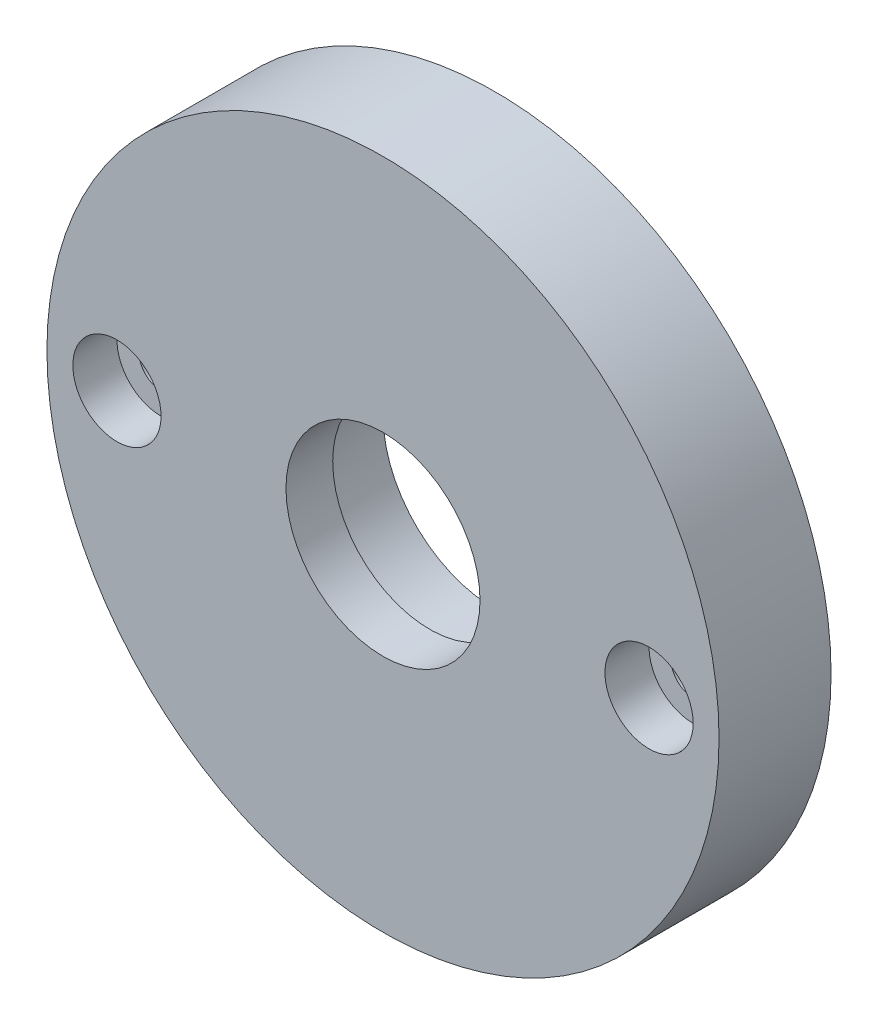
ISO-10303-21;
HEADER;
FILE_DESCRIPTION(('STEP AP214'),'2;1');
FILE_NAME('part.step','',(''),(''),'','','');
FILE_SCHEMA(('AUTOMOTIVE_DESIGN { 1 0 10303 214 1 1 1 1 }'));
ENDSEC;
DATA;
#1=APPLICATION_CONTEXT('core data for automotive mechanical design processes');
#2=APPLICATION_PROTOCOL_DEFINITION('international standard','automotive_design',2000,#1);
#3=PRODUCT_CONTEXT('',#1,'mechanical');
#4=PRODUCT('Part','Part','',(#3));
#5=PRODUCT_RELATED_PRODUCT_CATEGORY('part','',(#4));
#6=PRODUCT_DEFINITION_FORMATION('','',#4);
#7=PRODUCT_DEFINITION_CONTEXT('part definition',#1,'design');
#8=PRODUCT_DEFINITION('design','',#6,#7);
#9=PRODUCT_DEFINITION_SHAPE('','',#8);
#10=(LENGTH_UNIT() NAMED_UNIT(*) SI_UNIT(.MILLI.,.METRE.));
#11=(NAMED_UNIT(*) PLANE_ANGLE_UNIT() SI_UNIT($,.RADIAN.));
#12=(NAMED_UNIT(*) SI_UNIT($,.STERADIAN.) SOLID_ANGLE_UNIT());
#13=UNCERTAINTY_MEASURE_WITH_UNIT(LENGTH_MEASURE(1.E-05),#10,'distance_accuracy_value','');
#14=(GEOMETRIC_REPRESENTATION_CONTEXT(3) GLOBAL_UNCERTAINTY_ASSIGNED_CONTEXT((#13)) GLOBAL_UNIT_ASSIGNED_CONTEXT((#10,
#11,#12)) REPRESENTATION_CONTEXT('',''));
#15=CARTESIAN_POINT('',(0.,0.,0.));
#16=DIRECTION('',(0.,0.,1.));
#17=DIRECTION('',(1.,0.,0.));
#18=AXIS2_PLACEMENT_3D('',#15,#16,#17);
#19=CARTESIAN_POINT('',(-7.1502088960035,8.43588789117627,0.));
#20=DIRECTION('',(0.,0.,1.));
#21=DIRECTION('',(1.,0.,0.));
#22=AXIS2_PLACEMENT_3D('',#19,#20,#21);
#23=CYLINDRICAL_SURFACE('',#22,2.5);
#24=CARTESIAN_POINT('',(-7.1502088960035,8.43588789117627,0.));
#25=DIRECTION('',(0.,0.,1.));
#26=DIRECTION('',(1.,0.,0.));
#27=AXIS2_PLACEMENT_3D('',#24,#25,#26);
#28=CIRCLE('',#27,2.5);
#29=CARTESIAN_POINT('',(-4.65020889600349,8.43588789117627,0.));
#30=VERTEX_POINT('',#29);
#31=EDGE_CURVE('E69',#30,#30,#28,.T.);
#32=ORIENTED_EDGE('',*,*,#31,.F.);
#33=EDGE_LOOP('',(#32));
#34=FACE_BOUND('',#33,.T.);
#35=CARTESIAN_POINT('',(-7.1502088960035,8.43588789117627,7.7));
#36=DIRECTION('',(0.,0.,1.));
#37=DIRECTION('',(1.,0.,0.));
#38=AXIS2_PLACEMENT_3D('',#35,#36,#37);
#39=CIRCLE('',#38,2.5);
#40=CARTESIAN_POINT('',(-4.65020889600349,8.43588789117627,7.7));
#41=VERTEX_POINT('',#40);
#42=EDGE_CURVE('E40',#41,#41,#39,.F.);
#43=ORIENTED_EDGE('',*,*,#42,.F.);
#44=EDGE_LOOP('',(#43));
#45=FACE_BOUND('',#44,.T.);
#46=ADVANCED_FACE('F36',(#34,#45),#23,.F.);
#47=CARTESIAN_POINT('',(53.1747911039965,8.43588789117605,0.));
#48=DIRECTION('',(0.,0.,1.));
#49=DIRECTION('',(1.,0.,0.));
#50=AXIS2_PLACEMENT_3D('',#47,#48,#49);
#51=CYLINDRICAL_SURFACE('',#50,2.5);
#52=CARTESIAN_POINT('',(53.1747911039965,8.43588789117605,0.));
#53=DIRECTION('',(0.,0.,1.));
#54=DIRECTION('',(1.,0.,0.));
#55=AXIS2_PLACEMENT_3D('',#52,#53,#54);
#56=CIRCLE('',#55,2.5);
#57=CARTESIAN_POINT('',(55.6747911039965,8.43588789117605,0.));
#58=VERTEX_POINT('',#57);
#59=EDGE_CURVE('E87',#58,#58,#56,.T.);
#60=ORIENTED_EDGE('',*,*,#59,.F.);
#61=EDGE_LOOP('',(#60));
#62=FACE_BOUND('',#61,.T.);
#63=CARTESIAN_POINT('',(53.1747911039965,8.43588789117605,7.7));
#64=DIRECTION('',(0.,0.,1.));
#65=DIRECTION('',(1.,0.,0.));
#66=AXIS2_PLACEMENT_3D('',#63,#64,#65);
#67=CIRCLE('',#66,2.5);
#68=CARTESIAN_POINT('',(55.6747911039965,8.43588789117605,7.7));
#69=VERTEX_POINT('',#68);
#70=EDGE_CURVE('E60',#69,#69,#67,.F.);
#71=ORIENTED_EDGE('',*,*,#70,.F.);
#72=EDGE_LOOP('',(#71));
#73=FACE_BOUND('',#72,.T.);
#74=ADVANCED_FACE('F120',(#62,#73),#51,.F.);
#75=CARTESIAN_POINT('',(23.0122911039965,8.43588789117605,12.7));
#76=DIRECTION('',(0.,0.,-1.));
#77=DIRECTION('',(-1.,0.,0.));
#78=AXIS2_PLACEMENT_3D('',#75,#76,#77);
#79=CYLINDRICAL_SURFACE('',#78,11.);
#80=CARTESIAN_POINT('',(23.0122911039965,8.43588789117605,12.7));
#81=DIRECTION('',(0.,0.,1.));
#82=DIRECTION('',(1.,0.,0.));
#83=AXIS2_PLACEMENT_3D('',#80,#81,#82);
#84=CIRCLE('',#83,11.);
#85=CARTESIAN_POINT('',(34.0122911039965,8.43588789117605,12.7));
#86=VERTEX_POINT('',#85);
#87=EDGE_CURVE('E51',#86,#86,#84,.T.);
#88=ORIENTED_EDGE('',*,*,#87,.T.);
#89=EDGE_LOOP('',(#88));
#90=FACE_BOUND('',#89,.T.);
#91=CARTESIAN_POINT('',(23.0122911039965,8.43588789117605,7.4));
#92=DIRECTION('',(0.,0.,-1.));
#93=DIRECTION('',(-1.,0.,0.));
#94=AXIS2_PLACEMENT_3D('',#91,#92,#93);
#95=CIRCLE('',#94,11.);
#96=CARTESIAN_POINT('',(12.0122911039965,8.43588789117605,7.4));
#97=VERTEX_POINT('',#96);
#98=EDGE_CURVE('E56',#97,#97,#95,.T.);
#99=ORIENTED_EDGE('',*,*,#98,.T.);
#100=EDGE_LOOP('',(#99));
#101=FACE_BOUND('',#100,.T.);
#102=ADVANCED_FACE('F127',(#90,#101),#79,.F.);
#103=CARTESIAN_POINT('',(23.0122911039965,8.43588789117605,12.7));
#104=DIRECTION('',(0.,0.,1.));
#105=DIRECTION('',(1.,0.,0.));
#106=AXIS2_PLACEMENT_3D('',#103,#104,#105);
#107=PLANE('',#106);
#108=CARTESIAN_POINT('',(-7.1502088960035,8.43588789117627,12.7));
#109=DIRECTION('',(0.,0.,1.));
#110=DIRECTION('',(1.,0.,0.));
#111=AXIS2_PLACEMENT_3D('',#108,#109,#110);
#112=CIRCLE('',#111,5.);
#113=CARTESIAN_POINT('',(-2.1502088960035,8.43588789117627,12.7));
#114=VERTEX_POINT('',#113);
#115=EDGE_CURVE('E71',#114,#114,#112,.T.);
#116=ORIENTED_EDGE('',*,*,#115,.F.);
#117=EDGE_LOOP('',(#116));
#118=FACE_BOUND('',#117,.T.);
#119=CARTESIAN_POINT('',(53.1747911039965,8.43588789117605,12.7));
#120=DIRECTION('',(0.,0.,1.));
#121=DIRECTION('',(1.,0.,0.));
#122=AXIS2_PLACEMENT_3D('',#119,#120,#121);
#123=CIRCLE('',#122,5.);
#124=CARTESIAN_POINT('',(58.1747911039965,8.43588789117605,12.7));
#125=VERTEX_POINT('',#124);
#126=EDGE_CURVE('E83',#125,#125,#123,.T.);
#127=ORIENTED_EDGE('',*,*,#126,.F.);
#128=EDGE_LOOP('',(#127));
#129=FACE_BOUND('',#128,.T.);
#130=CARTESIAN_POINT('',(23.0122911039965,8.43588789117605,12.7));
#131=DIRECTION('',(0.,0.,1.));
#132=DIRECTION('',(1.,0.,0.));
#133=AXIS2_PLACEMENT_3D('',#130,#131,#132);
#134=CIRCLE('',#133,38.1);
#135=CARTESIAN_POINT('',(61.1122911039965,8.43588789117605,12.7));
#136=VERTEX_POINT('',#135);
#137=EDGE_CURVE('E10',#136,#136,#134,.T.);
#138=ORIENTED_EDGE('',*,*,#137,.T.);
#139=EDGE_LOOP('',(#138));
#140=FACE_BOUND('',#139,.T.);
#141=ORIENTED_EDGE('',*,*,#87,.F.);
#142=EDGE_LOOP('',(#141));
#143=FACE_BOUND('',#142,.T.);
#144=ADVANCED_FACE('F106',(#118,#129,#140,#143),#107,.T.);
#145=CARTESIAN_POINT('',(23.0122911039965,8.43588789117605,0.));
#146=DIRECTION('',(0.,0.,1.));
#147=DIRECTION('',(1.,0.,0.));
#148=AXIS2_PLACEMENT_3D('',#145,#146,#147);
#149=PLANE('',#148);
#150=ORIENTED_EDGE('',*,*,#59,.T.);
#151=EDGE_LOOP('',(#150));
#152=FACE_BOUND('',#151,.T.);
#153=ORIENTED_EDGE('',*,*,#31,.T.);
#154=EDGE_LOOP('',(#153));
#155=FACE_BOUND('',#154,.T.);
#156=CARTESIAN_POINT('',(23.0122911039965,8.43588789117605,0.));
#157=DIRECTION('',(0.,0.,-1.));
#158=DIRECTION('',(-1.,0.,0.));
#159=AXIS2_PLACEMENT_3D('',#156,#157,#158);
#160=CIRCLE('',#159,12.7);
#161=CARTESIAN_POINT('',(10.3122911039965,8.43588789117605,0.));
#162=VERTEX_POINT('',#161);
#163=EDGE_CURVE('E91',#162,#162,#160,.T.);
#164=ORIENTED_EDGE('',*,*,#163,.F.);
#165=EDGE_LOOP('',(#164));
#166=FACE_BOUND('',#165,.T.);
#167=CARTESIAN_POINT('',(23.0122911039965,8.43588789117605,0.));
#168=DIRECTION('',(0.,0.,1.));
#169=DIRECTION('',(1.,0.,0.));
#170=AXIS2_PLACEMENT_3D('',#167,#168,#169);
#171=CIRCLE('',#170,38.1);
#172=CARTESIAN_POINT('',(61.1122911039965,8.43588789117605,0.));
#173=VERTEX_POINT('',#172);
#174=EDGE_CURVE('E45',#173,#173,#171,.T.);
#175=ORIENTED_EDGE('',*,*,#174,.F.);
#176=EDGE_LOOP('',(#175));
#177=FACE_BOUND('',#176,.T.);
#178=ADVANCED_FACE('F103',(#152,#155,#166,#177),#149,.F.);
#179=CARTESIAN_POINT('',(23.0122911039965,8.43588789117605,12.7));
#180=DIRECTION('',(0.,0.,-1.));
#181=DIRECTION('',(-1.,0.,0.));
#182=AXIS2_PLACEMENT_3D('',#179,#180,#181);
#183=CYLINDRICAL_SURFACE('',#182,38.1);
#184=ORIENTED_EDGE('',*,*,#137,.F.);
#185=EDGE_LOOP('',(#184));
#186=FACE_BOUND('',#185,.T.);
#187=ORIENTED_EDGE('',*,*,#174,.T.);
#188=EDGE_LOOP('',(#187));
#189=FACE_BOUND('',#188,.T.);
#190=ADVANCED_FACE('F38',(#186,#189),#183,.T.);
#191=CARTESIAN_POINT('',(23.0122911039965,8.43588789117605,7.4));
#192=DIRECTION('',(0.,0.,-1.));
#193=DIRECTION('',(-1.,0.,0.));
#194=AXIS2_PLACEMENT_3D('',#191,#192,#193);
#195=CYLINDRICAL_SURFACE('',#194,12.7);
#196=CARTESIAN_POINT('',(23.0122911039965,8.43588789117605,7.4));
#197=DIRECTION('',(0.,0.,-1.));
#198=DIRECTION('',(-1.,0.,0.));
#199=AXIS2_PLACEMENT_3D('',#196,#197,#198);
#200=CIRCLE('',#199,12.7);
#201=CARTESIAN_POINT('',(10.3122911039965,8.43588789117605,7.4));
#202=VERTEX_POINT('',#201);
#203=EDGE_CURVE('E59',#202,#202,#200,.T.);
#204=ORIENTED_EDGE('',*,*,#203,.F.);
#205=EDGE_LOOP('',(#204));
#206=FACE_BOUND('',#205,.T.);
#207=ORIENTED_EDGE('',*,*,#163,.T.);
#208=EDGE_LOOP('',(#207));
#209=FACE_BOUND('',#208,.T.);
#210=ADVANCED_FACE('F101',(#206,#209),#195,.F.);
#211=CARTESIAN_POINT('',(23.0122911039965,8.43588789117605,7.4));
#212=DIRECTION('',(0.,0.,-1.));
#213=DIRECTION('',(-1.,0.,0.));
#214=AXIS2_PLACEMENT_3D('',#211,#212,#213);
#215=PLANE('',#214);
#216=ORIENTED_EDGE('',*,*,#98,.F.);
#217=EDGE_LOOP('',(#216));
#218=FACE_BOUND('',#217,.T.);
#219=ORIENTED_EDGE('',*,*,#203,.T.);
#220=EDGE_LOOP('',(#219));
#221=FACE_BOUND('',#220,.T.);
#222=ADVANCED_FACE('F116',(#218,#221),#215,.T.);
#223=CARTESIAN_POINT('',(53.1747911039965,8.43588789117605,7.7));
#224=DIRECTION('',(0.,0.,1.));
#225=DIRECTION('',(1.,0.,0.));
#226=AXIS2_PLACEMENT_3D('',#223,#224,#225);
#227=PLANE('',#226);
#228=CARTESIAN_POINT('',(53.1747911039965,8.43588789117605,7.7));
#229=DIRECTION('',(0.,0.,1.));
#230=DIRECTION('',(1.,0.,0.));
#231=AXIS2_PLACEMENT_3D('',#228,#229,#230);
#232=CIRCLE('',#231,5.);
#233=CARTESIAN_POINT('',(58.1747911039965,8.43588789117605,7.7));
#234=VERTEX_POINT('',#233);
#235=EDGE_CURVE('E77',#234,#234,#232,.T.);
#236=ORIENTED_EDGE('',*,*,#235,.T.);
#237=EDGE_LOOP('',(#236));
#238=FACE_BOUND('',#237,.T.);
#239=ORIENTED_EDGE('',*,*,#70,.T.);
#240=EDGE_LOOP('',(#239));
#241=FACE_BOUND('',#240,.T.);
#242=ADVANCED_FACE('F134',(#238,#241),#227,.T.);
#243=CARTESIAN_POINT('',(53.1747911039965,8.43588789117605,7.7));
#244=DIRECTION('',(0.,0.,1.));
#245=DIRECTION('',(1.,0.,0.));
#246=AXIS2_PLACEMENT_3D('',#243,#244,#245);
#247=CYLINDRICAL_SURFACE('',#246,5.);
#248=ORIENTED_EDGE('',*,*,#235,.F.);
#249=EDGE_LOOP('',(#248));
#250=FACE_BOUND('',#249,.T.);
#251=ORIENTED_EDGE('',*,*,#126,.T.);
#252=EDGE_LOOP('',(#251));
#253=FACE_BOUND('',#252,.T.);
#254=ADVANCED_FACE('F158',(#250,#253),#247,.F.);
#255=CARTESIAN_POINT('',(-7.1502088960035,8.43588789117627,7.7));
#256=DIRECTION('',(0.,0.,1.));
#257=DIRECTION('',(1.,0.,0.));
#258=AXIS2_PLACEMENT_3D('',#255,#256,#257);
#259=PLANE('',#258);
#260=CARTESIAN_POINT('',(-7.1502088960035,8.43588789117627,7.7));
#261=DIRECTION('',(0.,0.,1.));
#262=DIRECTION('',(1.,0.,0.));
#263=AXIS2_PLACEMENT_3D('',#260,#261,#262);
#264=CIRCLE('',#263,5.);
#265=CARTESIAN_POINT('',(-2.1502088960035,8.43588789117627,7.7));
#266=VERTEX_POINT('',#265);
#267=EDGE_CURVE('E63',#266,#266,#264,.T.);
#268=ORIENTED_EDGE('',*,*,#267,.T.);
#269=EDGE_LOOP('',(#268));
#270=FACE_BOUND('',#269,.T.);
#271=ORIENTED_EDGE('',*,*,#42,.T.);
#272=EDGE_LOOP('',(#271));
#273=FACE_BOUND('',#272,.T.);
#274=ADVANCED_FACE('F160',(#270,#273),#259,.T.);
#275=CARTESIAN_POINT('',(-7.1502088960035,8.43588789117627,7.7));
#276=DIRECTION('',(0.,0.,1.));
#277=DIRECTION('',(1.,0.,0.));
#278=AXIS2_PLACEMENT_3D('',#275,#276,#277);
#279=CYLINDRICAL_SURFACE('',#278,5.);
#280=ORIENTED_EDGE('',*,*,#267,.F.);
#281=EDGE_LOOP('',(#280));
#282=FACE_BOUND('',#281,.T.);
#283=ORIENTED_EDGE('',*,*,#115,.T.);
#284=EDGE_LOOP('',(#283));
#285=FACE_BOUND('',#284,.T.);
#286=ADVANCED_FACE('F166',(#282,#285),#279,.F.);
#287=CLOSED_SHELL('',(#46,#74,#102,#144,#178,#190,#210,#222,#242,#254,#274,#286));
#288=MANIFOLD_SOLID_BREP('B2',#287);
#289=ADVANCED_BREP_SHAPE_REPRESENTATION('',(#18,#288),#14);
#290=SHAPE_DEFINITION_REPRESENTATION(#9,#289);
ENDSEC;
END-ISO-10303-21;
